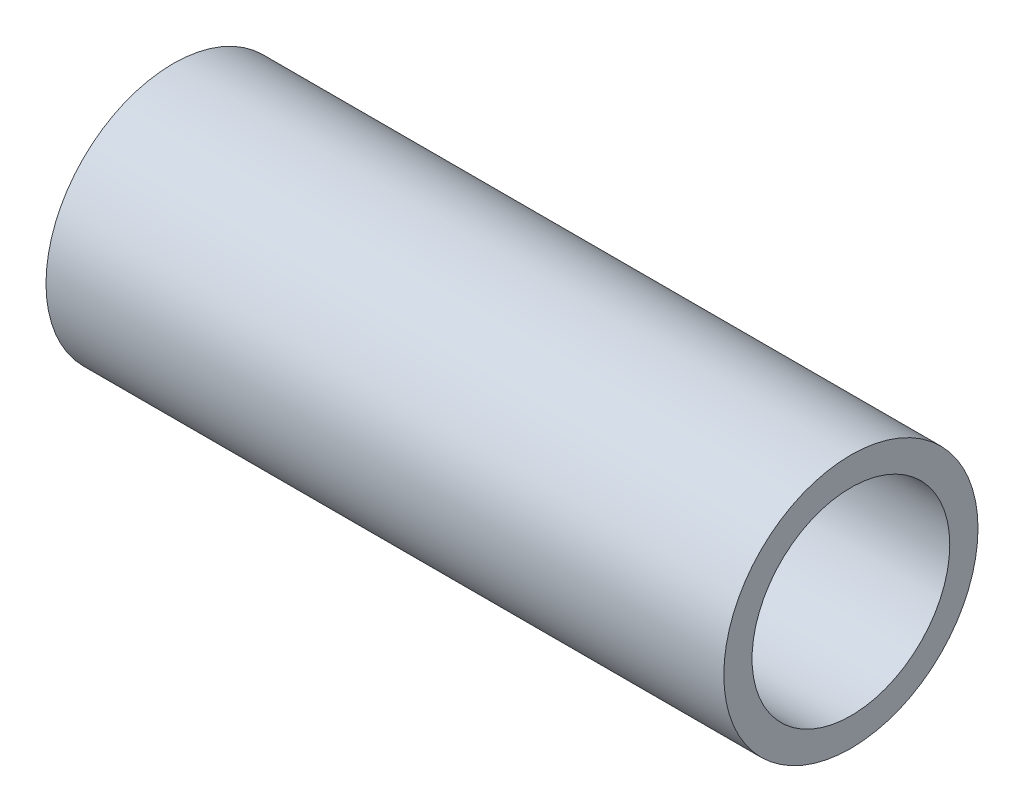
ISO-10303-21;
HEADER;
FILE_DESCRIPTION(('STEP AP214'),'2;1');
FILE_NAME('part.step','',(''),(''),'','','');
FILE_SCHEMA(('AUTOMOTIVE_DESIGN { 1 0 10303 214 1 1 1 1 }'));
ENDSEC;
DATA;
#1=APPLICATION_CONTEXT('core data for automotive mechanical design processes');
#2=APPLICATION_PROTOCOL_DEFINITION('international standard','automotive_design',2000,#1);
#3=PRODUCT_CONTEXT('',#1,'mechanical');
#4=PRODUCT('Part','Part','',(#3));
#5=PRODUCT_RELATED_PRODUCT_CATEGORY('part','',(#4));
#6=PRODUCT_DEFINITION_FORMATION('','',#4);
#7=PRODUCT_DEFINITION_CONTEXT('part definition',#1,'design');
#8=PRODUCT_DEFINITION('design','',#6,#7);
#9=PRODUCT_DEFINITION_SHAPE('','',#8);
#10=(LENGTH_UNIT() NAMED_UNIT(*) SI_UNIT(.MILLI.,.METRE.));
#11=(NAMED_UNIT(*) PLANE_ANGLE_UNIT() SI_UNIT($,.RADIAN.));
#12=(NAMED_UNIT(*) SI_UNIT($,.STERADIAN.) SOLID_ANGLE_UNIT());
#13=UNCERTAINTY_MEASURE_WITH_UNIT(LENGTH_MEASURE(1.E-05),#10,'distance_accuracy_value','');
#14=(GEOMETRIC_REPRESENTATION_CONTEXT(3) GLOBAL_UNCERTAINTY_ASSIGNED_CONTEXT((#13)) GLOBAL_UNIT_ASSIGNED_CONTEXT((#10,
#11,#12)) REPRESENTATION_CONTEXT('',''));
#15=CARTESIAN_POINT('',(0.,0.,0.));
#16=DIRECTION('',(0.,0.,1.));
#17=DIRECTION('',(1.,0.,0.));
#18=AXIS2_PLACEMENT_3D('',#15,#16,#17);
#19=CARTESIAN_POINT('',(24.,0.,0.));
#20=DIRECTION('',(1.,0.,0.));
#21=DIRECTION('',(0.,0.,-1.));
#22=AXIS2_PLACEMENT_3D('',#19,#20,#21);
#23=PLANE('',#22);
#24=CARTESIAN_POINT('',(24.,0.,0.));
#25=DIRECTION('',(1.,0.,0.));
#26=DIRECTION('',(0.,0.,-1.));
#27=AXIS2_PLACEMENT_3D('',#24,#25,#26);
#28=CIRCLE('',#27,9.);
#29=CARTESIAN_POINT('',(24.,0.,-9.));
#30=VERTEX_POINT('',#29);
#31=EDGE_CURVE('E10',#30,#30,#28,.T.);
#32=ORIENTED_EDGE('',*,*,#31,.T.);
#33=EDGE_LOOP('',(#32));
#34=FACE_BOUND('',#33,.T.);
#35=CARTESIAN_POINT('',(24.,0.,0.));
#36=DIRECTION('',(1.,0.,0.));
#37=DIRECTION('',(0.,0.,-1.));
#38=AXIS2_PLACEMENT_3D('',#35,#36,#37);
#39=CIRCLE('',#38,7.);
#40=CARTESIAN_POINT('',(24.,0.,-7.));
#41=VERTEX_POINT('',#40);
#42=EDGE_CURVE('E46',#41,#41,#39,.T.);
#43=ORIENTED_EDGE('',*,*,#42,.F.);
#44=EDGE_LOOP('',(#43));
#45=FACE_BOUND('',#44,.T.);
#46=ADVANCED_FACE('F35',(#34,#45),#23,.T.);
#47=CARTESIAN_POINT('',(-24.,0.,0.));
#48=DIRECTION('',(1.,0.,0.));
#49=DIRECTION('',(0.,0.,-1.));
#50=AXIS2_PLACEMENT_3D('',#47,#48,#49);
#51=PLANE('',#50);
#52=CARTESIAN_POINT('',(-24.,0.,0.));
#53=DIRECTION('',(1.,0.,0.));
#54=DIRECTION('',(0.,0.,-1.));
#55=AXIS2_PLACEMENT_3D('',#52,#53,#54);
#56=CIRCLE('',#55,9.);
#57=CARTESIAN_POINT('',(-24.,0.,-9.));
#58=VERTEX_POINT('',#57);
#59=EDGE_CURVE('E39',#58,#58,#56,.T.);
#60=ORIENTED_EDGE('',*,*,#59,.F.);
#61=EDGE_LOOP('',(#60));
#62=FACE_BOUND('',#61,.T.);
#63=CARTESIAN_POINT('',(-24.,0.,0.));
#64=DIRECTION('',(1.,0.,0.));
#65=DIRECTION('',(0.,0.,-1.));
#66=AXIS2_PLACEMENT_3D('',#63,#64,#65);
#67=CIRCLE('',#66,7.);
#68=CARTESIAN_POINT('',(-24.,0.,-7.));
#69=VERTEX_POINT('',#68);
#70=EDGE_CURVE('E48',#69,#69,#67,.T.);
#71=ORIENTED_EDGE('',*,*,#70,.T.);
#72=EDGE_LOOP('',(#71));
#73=FACE_BOUND('',#72,.T.);
#74=ADVANCED_FACE('F58',(#62,#73),#51,.F.);
#75=CARTESIAN_POINT('',(24.,0.,0.));
#76=DIRECTION('',(-1.,0.,0.));
#77=DIRECTION('',(0.,0.,1.));
#78=AXIS2_PLACEMENT_3D('',#75,#76,#77);
#79=CYLINDRICAL_SURFACE('',#78,9.);
#80=ORIENTED_EDGE('',*,*,#31,.F.);
#81=EDGE_LOOP('',(#80));
#82=FACE_BOUND('',#81,.T.);
#83=ORIENTED_EDGE('',*,*,#59,.T.);
#84=EDGE_LOOP('',(#83));
#85=FACE_BOUND('',#84,.T.);
#86=ADVANCED_FACE('F37',(#82,#85),#79,.T.);
#87=CARTESIAN_POINT('',(24.,0.,0.));
#88=DIRECTION('',(-1.,0.,0.));
#89=DIRECTION('',(0.,0.,1.));
#90=AXIS2_PLACEMENT_3D('',#87,#88,#89);
#91=CYLINDRICAL_SURFACE('',#90,7.);
#92=ORIENTED_EDGE('',*,*,#42,.T.);
#93=EDGE_LOOP('',(#92));
#94=FACE_BOUND('',#93,.T.);
#95=ORIENTED_EDGE('',*,*,#70,.F.);
#96=EDGE_LOOP('',(#95));
#97=FACE_BOUND('',#96,.T.);
#98=ADVANCED_FACE('F54',(#94,#97),#91,.F.);
#99=CLOSED_SHELL('',(#46,#74,#86,#98));
#100=MANIFOLD_SOLID_BREP('B2',#99);
#101=ADVANCED_BREP_SHAPE_REPRESENTATION('',(#18,#100),#14);
#102=SHAPE_DEFINITION_REPRESENTATION(#9,#101);
ENDSEC;
END-ISO-10303-21;
